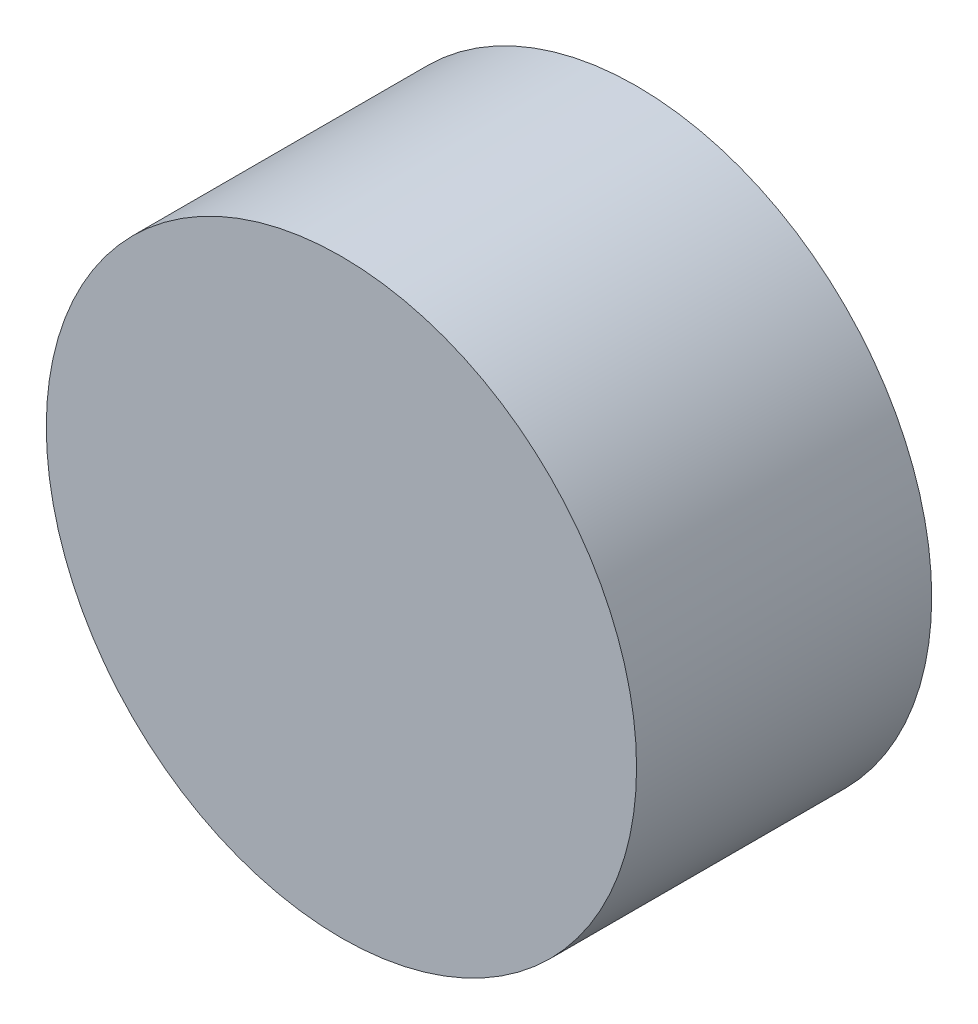
ISO-10303-21;
HEADER;
FILE_DESCRIPTION(('STEP AP214'),'2;1');
FILE_NAME('part.step','',(''),(''),'','','');
FILE_SCHEMA(('AUTOMOTIVE_DESIGN { 1 0 10303 214 1 1 1 1 }'));
ENDSEC;
DATA;
#1=APPLICATION_CONTEXT('core data for automotive mechanical design processes');
#2=APPLICATION_PROTOCOL_DEFINITION('international standard','automotive_design',2000,#1);
#3=PRODUCT_CONTEXT('',#1,'mechanical');
#4=PRODUCT('Part','Part','',(#3));
#5=PRODUCT_RELATED_PRODUCT_CATEGORY('part','',(#4));
#6=PRODUCT_DEFINITION_FORMATION('','',#4);
#7=PRODUCT_DEFINITION_CONTEXT('part definition',#1,'design');
#8=PRODUCT_DEFINITION('design','',#6,#7);
#9=PRODUCT_DEFINITION_SHAPE('','',#8);
#10=(LENGTH_UNIT() NAMED_UNIT(*) SI_UNIT(.MILLI.,.METRE.));
#11=(NAMED_UNIT(*) PLANE_ANGLE_UNIT() SI_UNIT($,.RADIAN.));
#12=(NAMED_UNIT(*) SI_UNIT($,.STERADIAN.) SOLID_ANGLE_UNIT());
#13=UNCERTAINTY_MEASURE_WITH_UNIT(LENGTH_MEASURE(1.E-05),#10,'distance_accuracy_value','');
#14=(GEOMETRIC_REPRESENTATION_CONTEXT(3) GLOBAL_UNCERTAINTY_ASSIGNED_CONTEXT((#13)) GLOBAL_UNIT_ASSIGNED_CONTEXT((#10,
#11,#12)) REPRESENTATION_CONTEXT('',''));
#15=CARTESIAN_POINT('',(0.,0.,0.));
#16=DIRECTION('',(0.,0.,1.));
#17=DIRECTION('',(1.,0.,0.));
#18=AXIS2_PLACEMENT_3D('',#15,#16,#17);
#19=CARTESIAN_POINT('',(0.,0.,-20.));
#20=DIRECTION('',(0.,0.,1.));
#21=DIRECTION('',(-1.,0.,0.));
#22=AXIS2_PLACEMENT_3D('',#19,#20,#21);
#23=CYLINDRICAL_SURFACE('',#22,20.);
#24=CARTESIAN_POINT('',(0.,0.,-20.));
#25=DIRECTION('',(0.,0.,1.));
#26=DIRECTION('',(1.,0.,0.));
#27=AXIS2_PLACEMENT_3D('',#24,#25,#26);
#28=CIRCLE('',#27,20.);
#29=CARTESIAN_POINT('',(20.,0.,-20.));
#30=VERTEX_POINT('',#29);
#31=EDGE_CURVE('E10',#30,#30,#28,.T.);
#32=ORIENTED_EDGE('',*,*,#31,.T.);
#33=EDGE_LOOP('',(#32));
#34=FACE_BOUND('',#33,.T.);
#35=CARTESIAN_POINT('',(0.,0.,0.));
#36=DIRECTION('',(0.,0.,1.));
#37=DIRECTION('',(1.,0.,0.));
#38=AXIS2_PLACEMENT_3D('',#35,#36,#37);
#39=CIRCLE('',#38,20.);
#40=CARTESIAN_POINT('',(20.,0.,0.));
#41=VERTEX_POINT('',#40);
#42=EDGE_CURVE('E36',#41,#41,#39,.T.);
#43=ORIENTED_EDGE('',*,*,#42,.F.);
#44=EDGE_LOOP('',(#43));
#45=FACE_BOUND('',#44,.T.);
#46=ADVANCED_FACE('F33',(#34,#45),#23,.T.);
#47=CARTESIAN_POINT('',(0.,0.,-20.));
#48=DIRECTION('',(0.,0.,-1.));
#49=DIRECTION('',(1.,0.,0.));
#50=AXIS2_PLACEMENT_3D('',#47,#48,#49);
#51=PLANE('',#50);
#52=CARTESIAN_POINT('',(0.,0.,-20.));
#53=DIRECTION('',(0.,0.,1.));
#54=DIRECTION('',(1.,0.,0.));
#55=AXIS2_PLACEMENT_3D('',#52,#53,#54);
#56=CIRCLE('',#55,2.5);
#57=CARTESIAN_POINT('',(2.5,0.,-20.));
#58=VERTEX_POINT('',#57);
#59=EDGE_CURVE('E43',#58,#58,#56,.F.);
#60=ORIENTED_EDGE('',*,*,#59,.F.);
#61=EDGE_LOOP('',(#60));
#62=FACE_BOUND('',#61,.T.);
#63=ORIENTED_EDGE('',*,*,#31,.F.);
#64=EDGE_LOOP('',(#63));
#65=FACE_BOUND('',#64,.T.);
#66=ADVANCED_FACE('F63',(#62,#65),#51,.T.);
#67=CARTESIAN_POINT('',(0.,0.,0.));
#68=DIRECTION('',(0.,0.,-1.));
#69=DIRECTION('',(1.,0.,0.));
#70=AXIS2_PLACEMENT_3D('',#67,#68,#69);
#71=PLANE('',#70);
#72=ORIENTED_EDGE('',*,*,#42,.T.);
#73=EDGE_LOOP('',(#72));
#74=FACE_BOUND('',#73,.T.);
#75=ADVANCED_FACE('F59',(#74),#71,.F.);
#76=CARTESIAN_POINT('',(0.,0.,-30.));
#77=DIRECTION('',(0.,0.,1.));
#78=DIRECTION('',(-1.,0.,0.));
#79=AXIS2_PLACEMENT_3D('',#76,#77,#78);
#80=CYLINDRICAL_SURFACE('',#79,2.5);
#81=ORIENTED_EDGE('',*,*,#59,.T.);
#82=EDGE_LOOP('',(#81));
#83=FACE_BOUND('',#82,.T.);
#84=CARTESIAN_POINT('',(0.,0.,-30.));
#85=DIRECTION('',(0.,0.,1.));
#86=DIRECTION('',(1.,0.,0.));
#87=AXIS2_PLACEMENT_3D('',#84,#85,#86);
#88=CIRCLE('',#87,2.5);
#89=CARTESIAN_POINT('',(2.5,0.,-30.));
#90=VERTEX_POINT('',#89);
#91=EDGE_CURVE('E47',#90,#90,#88,.T.);
#92=ORIENTED_EDGE('',*,*,#91,.T.);
#93=EDGE_LOOP('',(#92));
#94=FACE_BOUND('',#93,.T.);
#95=ADVANCED_FACE('F51',(#83,#94),#80,.T.);
#96=CARTESIAN_POINT('',(0.,0.,-30.));
#97=DIRECTION('',(0.,0.,-1.));
#98=DIRECTION('',(1.,0.,0.));
#99=AXIS2_PLACEMENT_3D('',#96,#97,#98);
#100=PLANE('',#99);
#101=ORIENTED_EDGE('',*,*,#91,.F.);
#102=EDGE_LOOP('',(#101));
#103=FACE_BOUND('',#102,.T.);
#104=ADVANCED_FACE('F53',(#103),#100,.T.);
#105=CLOSED_SHELL('',(#46,#66,#75,#95,#104));
#106=MANIFOLD_SOLID_BREP('B2',#105);
#107=ADVANCED_BREP_SHAPE_REPRESENTATION('',(#18,#106),#14);
#108=SHAPE_DEFINITION_REPRESENTATION(#9,#107);
ENDSEC;
END-ISO-10303-21;
